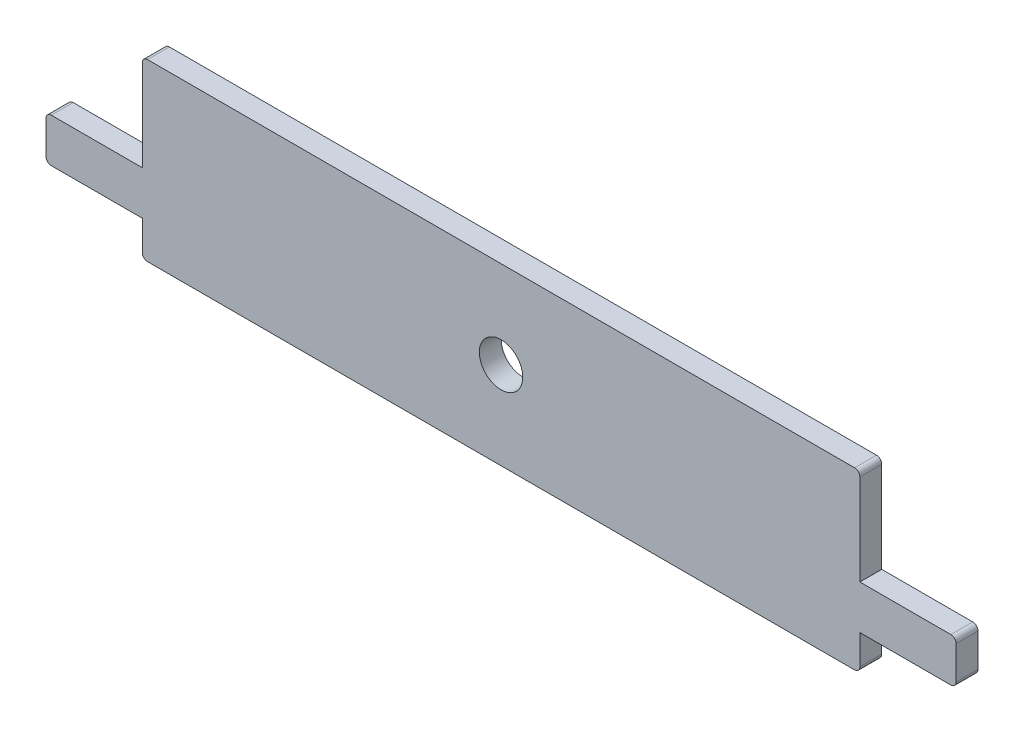
ISO-10303-21;
HEADER;
FILE_DESCRIPTION(('STEP AP214'),'2;1');
FILE_NAME('part.step','',(''),(''),'','','');
FILE_SCHEMA(('AUTOMOTIVE_DESIGN { 1 0 10303 214 1 1 1 1 }'));
ENDSEC;
DATA;
#1=APPLICATION_CONTEXT('core data for automotive mechanical design processes');
#2=APPLICATION_PROTOCOL_DEFINITION('international standard','automotive_design',2000,#1);
#3=PRODUCT_CONTEXT('',#1,'mechanical');
#4=PRODUCT('Part','Part','',(#3));
#5=PRODUCT_RELATED_PRODUCT_CATEGORY('part','',(#4));
#6=PRODUCT_DEFINITION_FORMATION('','',#4);
#7=PRODUCT_DEFINITION_CONTEXT('part definition',#1,'design');
#8=PRODUCT_DEFINITION('design','',#6,#7);
#9=PRODUCT_DEFINITION_SHAPE('','',#8);
#10=(LENGTH_UNIT() NAMED_UNIT(*) SI_UNIT(.MILLI.,.METRE.));
#11=(NAMED_UNIT(*) PLANE_ANGLE_UNIT() SI_UNIT($,.RADIAN.));
#12=(NAMED_UNIT(*) SI_UNIT($,.STERADIAN.) SOLID_ANGLE_UNIT());
#13=UNCERTAINTY_MEASURE_WITH_UNIT(LENGTH_MEASURE(1.E-05),#10,'distance_accuracy_value','');
#14=(GEOMETRIC_REPRESENTATION_CONTEXT(3) GLOBAL_UNCERTAINTY_ASSIGNED_CONTEXT((#13)) GLOBAL_UNIT_ASSIGNED_CONTEXT((#10,
#11,#12)) REPRESENTATION_CONTEXT('',''));
#15=CARTESIAN_POINT('',(0.,0.,0.));
#16=DIRECTION('',(0.,0.,1.));
#17=DIRECTION('',(1.,0.,0.));
#18=AXIS2_PLACEMENT_3D('',#15,#16,#17);
#19=CARTESIAN_POINT('',(103.378,0.762,3.175));
#20=DIRECTION('',(0.,0.,1.));
#21=DIRECTION('',(1.,0.,0.));
#22=AXIS2_PLACEMENT_3D('',#19,#20,#21);
#23=PLANE('',#22);
#24=CARTESIAN_POINT('',(103.378,0.762,3.175));
#25=DIRECTION('',(0.,0.,1.));
#26=DIRECTION('',(1.,0.,0.));
#27=AXIS2_PLACEMENT_3D('',#24,#25,#26);
#28=CIRCLE('',#27,0.761999999999999);
#29=CARTESIAN_POINT('',(103.378,0.,3.175));
#30=VERTEX_POINT('',#29);
#31=CARTESIAN_POINT('',(104.14,0.762000000000005,3.175));
#32=VERTEX_POINT('',#31);
#33=EDGE_CURVE('E240',#30,#32,#28,.T.);
#34=ORIENTED_EDGE('',*,*,#33,.T.);
#35=DIRECTION('',(0.,1.,0.));
#36=VECTOR('',#35,1.);
#37=CARTESIAN_POINT('',(104.14,0.762000000000005,3.175));
#38=LINE('',#37,#36);
#39=CARTESIAN_POINT('',(104.14,5.08000000000001,3.175));
#40=VERTEX_POINT('',#39);
#41=EDGE_CURVE('E128',#32,#40,#38,.T.);
#42=ORIENTED_EDGE('',*,*,#41,.T.);
#43=DIRECTION('',(1.,0.,0.));
#44=VECTOR('',#43,1.);
#45=CARTESIAN_POINT('',(104.14,5.08000000000001,3.175));
#46=LINE('',#45,#44);
#47=CARTESIAN_POINT('',(117.348,5.08000000000001,3.175));
#48=VERTEX_POINT('',#47);
#49=EDGE_CURVE('E291',#40,#48,#46,.T.);
#50=ORIENTED_EDGE('',*,*,#49,.T.);
#51=CARTESIAN_POINT('',(117.348,5.84200000000001,3.175));
#52=DIRECTION('',(0.,0.,1.));
#53=DIRECTION('',(1.,0.,0.));
#54=AXIS2_PLACEMENT_3D('',#51,#52,#53);
#55=CIRCLE('',#54,0.761999999999999);
#56=CARTESIAN_POINT('',(118.11,5.84200000000002,3.175));
#57=VERTEX_POINT('',#56);
#58=EDGE_CURVE('E310',#48,#57,#55,.T.);
#59=ORIENTED_EDGE('',*,*,#58,.T.);
#60=DIRECTION('',(0.,1.,0.));
#61=VECTOR('',#60,1.);
#62=CARTESIAN_POINT('',(118.11,5.84200000000002,3.175));
#63=LINE('',#62,#61);
#64=CARTESIAN_POINT('',(118.11,10.668,3.175));
#65=VERTEX_POINT('',#64);
#66=EDGE_CURVE('E307',#57,#65,#63,.T.);
#67=ORIENTED_EDGE('',*,*,#66,.T.);
#68=CARTESIAN_POINT('',(117.348,10.668,3.175));
#69=DIRECTION('',(0.,0.,1.));
#70=DIRECTION('',(-1.,0.,0.));
#71=AXIS2_PLACEMENT_3D('',#68,#69,#70);
#72=CIRCLE('',#71,0.762);
#73=CARTESIAN_POINT('',(117.348,11.43,3.175));
#74=VERTEX_POINT('',#73);
#75=EDGE_CURVE('E309',#65,#74,#72,.T.);
#76=ORIENTED_EDGE('',*,*,#75,.T.);
#77=DIRECTION('',(-1.,0.,0.));
#78=VECTOR('',#77,1.);
#79=CARTESIAN_POINT('',(104.14,11.43,3.175));
#80=LINE('',#79,#78);
#81=CARTESIAN_POINT('',(104.14,11.43,3.175));
#82=VERTEX_POINT('',#81);
#83=EDGE_CURVE('E312',#74,#82,#80,.T.);
#84=ORIENTED_EDGE('',*,*,#83,.T.);
#85=DIRECTION('',(0.,1.,0.));
#86=VECTOR('',#85,1.);
#87=CARTESIAN_POINT('',(104.14,11.43,3.175));
#88=LINE('',#87,#86);
#89=CARTESIAN_POINT('',(104.14,24.638,3.175));
#90=VERTEX_POINT('',#89);
#91=EDGE_CURVE('E318',#82,#90,#88,.T.);
#92=ORIENTED_EDGE('',*,*,#91,.T.);
#93=CARTESIAN_POINT('',(103.378,24.638,3.175));
#94=DIRECTION('',(0.,0.,1.));
#95=DIRECTION('',(-1.,0.,0.));
#96=AXIS2_PLACEMENT_3D('',#93,#94,#95);
#97=CIRCLE('',#96,0.761999999999999);
#98=CARTESIAN_POINT('',(103.378,25.4,3.175));
#99=VERTEX_POINT('',#98);
#100=EDGE_CURVE('E320',#90,#99,#97,.T.);
#101=ORIENTED_EDGE('',*,*,#100,.T.);
#102=DIRECTION('',(-1.,0.,0.));
#103=VECTOR('',#102,1.);
#104=CARTESIAN_POINT('',(0.762000000000005,25.4,3.175));
#105=LINE('',#104,#103);
#106=CARTESIAN_POINT('',(0.762000000000005,25.4,3.175));
#107=VERTEX_POINT('',#106);
#108=EDGE_CURVE('E322',#99,#107,#105,.T.);
#109=ORIENTED_EDGE('',*,*,#108,.T.);
#110=CARTESIAN_POINT('',(0.762,24.638,3.175));
#111=DIRECTION('',(0.,0.,1.));
#112=DIRECTION('',(-1.,0.,0.));
#113=AXIS2_PLACEMENT_3D('',#110,#111,#112);
#114=CIRCLE('',#113,0.761999999999999);
#115=CARTESIAN_POINT('',(0.,24.638,3.175));
#116=VERTEX_POINT('',#115);
#117=EDGE_CURVE('E324',#107,#116,#114,.T.);
#118=ORIENTED_EDGE('',*,*,#117,.T.);
#119=DIRECTION('',(0.,-1.,0.));
#120=VECTOR('',#119,1.);
#121=CARTESIAN_POINT('',(0.,11.43,3.175));
#122=LINE('',#121,#120);
#123=CARTESIAN_POINT('',(0.,11.43,3.175));
#124=VERTEX_POINT('',#123);
#125=EDGE_CURVE('E326',#116,#124,#122,.T.);
#126=ORIENTED_EDGE('',*,*,#125,.T.);
#127=DIRECTION('',(-1.,0.,0.));
#128=VECTOR('',#127,1.);
#129=CARTESIAN_POINT('',(-13.208,11.43,3.175));
#130=LINE('',#129,#128);
#131=CARTESIAN_POINT('',(-13.208,11.43,3.175));
#132=VERTEX_POINT('',#131);
#133=EDGE_CURVE('E328',#124,#132,#130,.T.);
#134=ORIENTED_EDGE('',*,*,#133,.T.);
#135=CARTESIAN_POINT('',(-13.208,10.668,3.175));
#136=DIRECTION('',(0.,0.,1.));
#137=DIRECTION('',(-1.,0.,0.));
#138=AXIS2_PLACEMENT_3D('',#135,#136,#137);
#139=CIRCLE('',#138,0.762000000000001);
#140=CARTESIAN_POINT('',(-13.97,10.668,3.175));
#141=VERTEX_POINT('',#140);
#142=EDGE_CURVE('E330',#132,#141,#139,.T.);
#143=ORIENTED_EDGE('',*,*,#142,.T.);
#144=DIRECTION('',(0.,-1.,0.));
#145=VECTOR('',#144,1.);
#146=CARTESIAN_POINT('',(-13.97,5.842,3.175));
#147=LINE('',#146,#145);
#148=CARTESIAN_POINT('',(-13.97,5.842,3.175));
#149=VERTEX_POINT('',#148);
#150=EDGE_CURVE('E332',#141,#149,#147,.T.);
#151=ORIENTED_EDGE('',*,*,#150,.T.);
#152=CARTESIAN_POINT('',(-13.208,5.842,3.175));
#153=DIRECTION('',(0.,0.,1.));
#154=DIRECTION('',(-1.,0.,0.));
#155=AXIS2_PLACEMENT_3D('',#152,#153,#154);
#156=CIRCLE('',#155,0.762000000000001);
#157=CARTESIAN_POINT('',(-13.208,5.07999999999999,3.175));
#158=VERTEX_POINT('',#157);
#159=EDGE_CURVE('E334',#149,#158,#156,.T.);
#160=ORIENTED_EDGE('',*,*,#159,.T.);
#161=DIRECTION('',(1.,0.,0.));
#162=VECTOR('',#161,1.);
#163=CARTESIAN_POINT('',(-13.208,5.07999999999999,3.175));
#164=LINE('',#163,#162);
#165=CARTESIAN_POINT('',(0.,5.08,3.175));
#166=VERTEX_POINT('',#165);
#167=EDGE_CURVE('E183',#158,#166,#164,.T.);
#168=ORIENTED_EDGE('',*,*,#167,.T.);
#169=DIRECTION('',(0.,-1.,0.));
#170=VECTOR('',#169,1.);
#171=CARTESIAN_POINT('',(0.,0.762000000000005,3.175));
#172=LINE('',#171,#170);
#173=CARTESIAN_POINT('',(0.,0.762,3.175));
#174=VERTEX_POINT('',#173);
#175=EDGE_CURVE('E177',#166,#174,#172,.T.);
#176=ORIENTED_EDGE('',*,*,#175,.T.);
#177=CARTESIAN_POINT('',(0.762,0.762,3.175));
#178=DIRECTION('',(0.,0.,1.));
#179=DIRECTION('',(-1.,0.,0.));
#180=AXIS2_PLACEMENT_3D('',#177,#178,#179);
#181=CIRCLE('',#180,0.762);
#182=CARTESIAN_POINT('',(0.762000000000005,0.,3.175));
#183=VERTEX_POINT('',#182);
#184=EDGE_CURVE('E181',#174,#183,#181,.T.);
#185=ORIENTED_EDGE('',*,*,#184,.T.);
#186=DIRECTION('',(1.,0.,0.));
#187=VECTOR('',#186,1.);
#188=CARTESIAN_POINT('',(0.762000000000005,0.,3.175));
#189=LINE('',#188,#187);
#190=EDGE_CURVE('E49',#183,#30,#189,.T.);
#191=ORIENTED_EDGE('',*,*,#190,.T.);
#192=EDGE_LOOP('',(#34,#42,#50,#59,#67,#76,#84,#92,#101,#109,#118,#126,#134,#143,#151,#160,#168,
#176,#185,#191));
#193=FACE_BOUND('',#192,.T.);
#194=CARTESIAN_POINT('',(52.07,12.7,3.175));
#195=DIRECTION('',(0.,0.,1.));
#196=DIRECTION('',(1.,0.,0.));
#197=AXIS2_PLACEMENT_3D('',#194,#195,#196);
#198=CIRCLE('',#197,3.1496);
#199=CARTESIAN_POINT('',(55.2196,12.7,3.175));
#200=VERTEX_POINT('',#199);
#201=EDGE_CURVE('E205',#200,#200,#198,.T.);
#202=ORIENTED_EDGE('',*,*,#201,.F.);
#203=EDGE_LOOP('',(#202));
#204=FACE_BOUND('',#203,.T.);
#205=ADVANCED_FACE('F32',(#193,#204),#23,.T.);
#206=CARTESIAN_POINT('',(103.378,0.762,0.));
#207=DIRECTION('',(0.,0.,1.));
#208=DIRECTION('',(1.,0.,0.));
#209=AXIS2_PLACEMENT_3D('',#206,#207,#208);
#210=PLANE('',#209);
#211=CARTESIAN_POINT('',(103.378,0.762,0.));
#212=DIRECTION('',(0.,0.,1.));
#213=DIRECTION('',(1.,0.,0.));
#214=AXIS2_PLACEMENT_3D('',#211,#212,#213);
#215=CIRCLE('',#214,0.761999999999999);
#216=CARTESIAN_POINT('',(103.378,0.,0.));
#217=VERTEX_POINT('',#216);
#218=CARTESIAN_POINT('',(104.14,0.762000000000005,0.));
#219=VERTEX_POINT('',#218);
#220=EDGE_CURVE('E201',#217,#219,#215,.T.);
#221=ORIENTED_EDGE('',*,*,#220,.F.);
#222=DIRECTION('',(1.,0.,0.));
#223=VECTOR('',#222,1.);
#224=CARTESIAN_POINT('',(0.762000000000005,0.,0.));
#225=LINE('',#224,#223);
#226=CARTESIAN_POINT('',(0.762000000000005,0.,0.));
#227=VERTEX_POINT('',#226);
#228=EDGE_CURVE('E120',#227,#217,#225,.T.);
#229=ORIENTED_EDGE('',*,*,#228,.F.);
#230=CARTESIAN_POINT('',(0.762,0.762,0.));
#231=DIRECTION('',(0.,0.,1.));
#232=DIRECTION('',(-1.,0.,0.));
#233=AXIS2_PLACEMENT_3D('',#230,#231,#232);
#234=CIRCLE('',#233,0.762);
#235=CARTESIAN_POINT('',(0.,0.762,0.));
#236=VERTEX_POINT('',#235);
#237=EDGE_CURVE('E114',#236,#227,#234,.T.);
#238=ORIENTED_EDGE('',*,*,#237,.F.);
#239=DIRECTION('',(0.,-1.,0.));
#240=VECTOR('',#239,1.);
#241=CARTESIAN_POINT('',(0.,0.762000000000005,0.));
#242=LINE('',#241,#240);
#243=CARTESIAN_POINT('',(0.,5.08,0.));
#244=VERTEX_POINT('',#243);
#245=EDGE_CURVE('E191',#244,#236,#242,.T.);
#246=ORIENTED_EDGE('',*,*,#245,.F.);
#247=DIRECTION('',(1.,0.,0.));
#248=VECTOR('',#247,1.);
#249=CARTESIAN_POINT('',(-13.208,5.07999999999999,0.));
#250=LINE('',#249,#248);
#251=CARTESIAN_POINT('',(-13.208,5.07999999999999,0.));
#252=VERTEX_POINT('',#251);
#253=EDGE_CURVE('E235',#252,#244,#250,.T.);
#254=ORIENTED_EDGE('',*,*,#253,.F.);
#255=CARTESIAN_POINT('',(-13.208,5.842,0.));
#256=DIRECTION('',(0.,0.,1.));
#257=DIRECTION('',(-1.,0.,0.));
#258=AXIS2_PLACEMENT_3D('',#255,#256,#257);
#259=CIRCLE('',#258,0.762000000000001);
#260=CARTESIAN_POINT('',(-13.97,5.842,0.));
#261=VERTEX_POINT('',#260);
#262=EDGE_CURVE('E233',#261,#252,#259,.T.);
#263=ORIENTED_EDGE('',*,*,#262,.F.);
#264=DIRECTION('',(0.,-1.,0.));
#265=VECTOR('',#264,1.);
#266=CARTESIAN_POINT('',(-13.97,5.842,0.));
#267=LINE('',#266,#265);
#268=CARTESIAN_POINT('',(-13.97,10.668,0.));
#269=VERTEX_POINT('',#268);
#270=EDGE_CURVE('E231',#269,#261,#267,.T.);
#271=ORIENTED_EDGE('',*,*,#270,.F.);
#272=CARTESIAN_POINT('',(-13.208,10.668,0.));
#273=DIRECTION('',(0.,0.,1.));
#274=DIRECTION('',(-1.,0.,0.));
#275=AXIS2_PLACEMENT_3D('',#272,#273,#274);
#276=CIRCLE('',#275,0.762000000000001);
#277=CARTESIAN_POINT('',(-13.208,11.43,0.));
#278=VERTEX_POINT('',#277);
#279=EDGE_CURVE('E229',#278,#269,#276,.T.);
#280=ORIENTED_EDGE('',*,*,#279,.F.);
#281=DIRECTION('',(-1.,0.,0.));
#282=VECTOR('',#281,1.);
#283=CARTESIAN_POINT('',(-13.208,11.43,0.));
#284=LINE('',#283,#282);
#285=CARTESIAN_POINT('',(0.,11.43,0.));
#286=VERTEX_POINT('',#285);
#287=EDGE_CURVE('E227',#286,#278,#284,.T.);
#288=ORIENTED_EDGE('',*,*,#287,.F.);
#289=DIRECTION('',(0.,-1.,0.));
#290=VECTOR('',#289,1.);
#291=CARTESIAN_POINT('',(0.,11.43,0.));
#292=LINE('',#291,#290);
#293=CARTESIAN_POINT('',(0.,24.638,0.));
#294=VERTEX_POINT('',#293);
#295=EDGE_CURVE('E225',#294,#286,#292,.T.);
#296=ORIENTED_EDGE('',*,*,#295,.F.);
#297=CARTESIAN_POINT('',(0.762,24.638,0.));
#298=DIRECTION('',(0.,0.,1.));
#299=DIRECTION('',(-1.,0.,0.));
#300=AXIS2_PLACEMENT_3D('',#297,#298,#299);
#301=CIRCLE('',#300,0.761999999999999);
#302=CARTESIAN_POINT('',(0.762000000000005,25.4,0.));
#303=VERTEX_POINT('',#302);
#304=EDGE_CURVE('E223',#303,#294,#301,.T.);
#305=ORIENTED_EDGE('',*,*,#304,.F.);
#306=DIRECTION('',(-1.,0.,0.));
#307=VECTOR('',#306,1.);
#308=CARTESIAN_POINT('',(0.762000000000005,25.4,0.));
#309=LINE('',#308,#307);
#310=CARTESIAN_POINT('',(103.378,25.4,0.));
#311=VERTEX_POINT('',#310);
#312=EDGE_CURVE('E221',#311,#303,#309,.T.);
#313=ORIENTED_EDGE('',*,*,#312,.F.);
#314=CARTESIAN_POINT('',(103.378,24.638,0.));
#315=DIRECTION('',(0.,0.,1.));
#316=DIRECTION('',(-1.,0.,0.));
#317=AXIS2_PLACEMENT_3D('',#314,#315,#316);
#318=CIRCLE('',#317,0.761999999999999);
#319=CARTESIAN_POINT('',(104.14,24.638,0.));
#320=VERTEX_POINT('',#319);
#321=EDGE_CURVE('E219',#320,#311,#318,.T.);
#322=ORIENTED_EDGE('',*,*,#321,.F.);
#323=DIRECTION('',(0.,1.,0.));
#324=VECTOR('',#323,1.);
#325=CARTESIAN_POINT('',(104.14,11.43,0.));
#326=LINE('',#325,#324);
#327=CARTESIAN_POINT('',(104.14,11.43,0.));
#328=VERTEX_POINT('',#327);
#329=EDGE_CURVE('E217',#328,#320,#326,.T.);
#330=ORIENTED_EDGE('',*,*,#329,.F.);
#331=DIRECTION('',(-1.,0.,0.));
#332=VECTOR('',#331,1.);
#333=CARTESIAN_POINT('',(104.14,11.43,0.));
#334=LINE('',#333,#332);
#335=CARTESIAN_POINT('',(117.348,11.43,0.));
#336=VERTEX_POINT('',#335);
#337=EDGE_CURVE('E215',#336,#328,#334,.T.);
#338=ORIENTED_EDGE('',*,*,#337,.F.);
#339=CARTESIAN_POINT('',(117.348,10.668,0.));
#340=DIRECTION('',(0.,0.,1.));
#341=DIRECTION('',(-1.,0.,0.));
#342=AXIS2_PLACEMENT_3D('',#339,#340,#341);
#343=CIRCLE('',#342,0.762);
#344=CARTESIAN_POINT('',(118.11,10.668,0.));
#345=VERTEX_POINT('',#344);
#346=EDGE_CURVE('E213',#345,#336,#343,.T.);
#347=ORIENTED_EDGE('',*,*,#346,.F.);
#348=DIRECTION('',(0.,1.,0.));
#349=VECTOR('',#348,1.);
#350=CARTESIAN_POINT('',(118.11,5.84200000000002,0.));
#351=LINE('',#350,#349);
#352=CARTESIAN_POINT('',(118.11,5.84200000000002,0.));
#353=VERTEX_POINT('',#352);
#354=EDGE_CURVE('E211',#353,#345,#351,.T.);
#355=ORIENTED_EDGE('',*,*,#354,.F.);
#356=CARTESIAN_POINT('',(117.348,5.84200000000001,0.));
#357=DIRECTION('',(0.,0.,1.));
#358=DIRECTION('',(1.,0.,0.));
#359=AXIS2_PLACEMENT_3D('',#356,#357,#358);
#360=CIRCLE('',#359,0.761999999999999);
#361=CARTESIAN_POINT('',(117.348,5.08000000000001,0.));
#362=VERTEX_POINT('',#361);
#363=EDGE_CURVE('E209',#362,#353,#360,.T.);
#364=ORIENTED_EDGE('',*,*,#363,.F.);
#365=DIRECTION('',(1.,0.,0.));
#366=VECTOR('',#365,1.);
#367=CARTESIAN_POINT('',(104.14,5.08000000000001,0.));
#368=LINE('',#367,#366);
#369=CARTESIAN_POINT('',(104.14,5.08000000000001,0.));
#370=VERTEX_POINT('',#369);
#371=EDGE_CURVE('E207',#370,#362,#368,.T.);
#372=ORIENTED_EDGE('',*,*,#371,.F.);
#373=DIRECTION('',(0.,1.,0.));
#374=VECTOR('',#373,1.);
#375=CARTESIAN_POINT('',(104.14,0.762000000000005,0.));
#376=LINE('',#375,#374);
#377=EDGE_CURVE('E204',#219,#370,#376,.T.);
#378=ORIENTED_EDGE('',*,*,#377,.F.);
#379=EDGE_LOOP('',(#221,#229,#238,#246,#254,#263,#271,#280,#288,#296,#305,#313,#322,#330,#338,
#347,#355,#364,#372,#378));
#380=FACE_BOUND('',#379,.T.);
#381=CARTESIAN_POINT('',(52.07,12.7,0.));
#382=DIRECTION('',(0.,0.,1.));
#383=DIRECTION('',(1.,0.,0.));
#384=AXIS2_PLACEMENT_3D('',#381,#382,#383);
#385=CIRCLE('',#384,3.1496);
#386=CARTESIAN_POINT('',(55.2196,12.7,0.));
#387=VERTEX_POINT('',#386);
#388=EDGE_CURVE('E585',#387,#387,#385,.T.);
#389=ORIENTED_EDGE('',*,*,#388,.T.);
#390=EDGE_LOOP('',(#389));
#391=FACE_BOUND('',#390,.T.);
#392=ADVANCED_FACE('F295',(#380,#391),#210,.F.);
#393=CARTESIAN_POINT('',(103.378,0.762,3.175));
#394=DIRECTION('',(0.,0.,-1.));
#395=DIRECTION('',(-1.,0.,0.));
#396=AXIS2_PLACEMENT_3D('',#393,#394,#395);
#397=CYLINDRICAL_SURFACE('',#396,0.761999999999999);
#398=ORIENTED_EDGE('',*,*,#220,.T.);
#399=DIRECTION('',(0.,0.,-1.));
#400=VECTOR('',#399,1.);
#401=CARTESIAN_POINT('',(104.14,0.762000000000005,3.175));
#402=LINE('',#401,#400);
#403=EDGE_CURVE('E11',#32,#219,#402,.T.);
#404=ORIENTED_EDGE('',*,*,#403,.F.);
#405=ORIENTED_EDGE('',*,*,#33,.F.);
#406=DIRECTION('',(0.,0.,-1.));
#407=VECTOR('',#406,1.);
#408=CARTESIAN_POINT('',(103.378,0.,3.175));
#409=LINE('',#408,#407);
#410=EDGE_CURVE('E197',#30,#217,#409,.T.);
#411=ORIENTED_EDGE('',*,*,#410,.T.);
#412=EDGE_LOOP('',(#398,#404,#405,#411));
#413=FACE_BOUND('',#412,.T.);
#414=ADVANCED_FACE('F34',(#413),#397,.T.);
#415=CARTESIAN_POINT('',(104.14,0.762000000000005,3.175));
#416=DIRECTION('',(-1.,0.,0.));
#417=DIRECTION('',(0.,0.,1.));
#418=AXIS2_PLACEMENT_3D('',#415,#416,#417);
#419=PLANE('',#418);
#420=ORIENTED_EDGE('',*,*,#377,.T.);
#421=DIRECTION('',(0.,0.,-1.));
#422=VECTOR('',#421,1.);
#423=CARTESIAN_POINT('',(104.14,5.08000000000001,3.175));
#424=LINE('',#423,#422);
#425=EDGE_CURVE('E41',#40,#370,#424,.T.);
#426=ORIENTED_EDGE('',*,*,#425,.F.);
#427=ORIENTED_EDGE('',*,*,#41,.F.);
#428=ORIENTED_EDGE('',*,*,#403,.T.);
#429=EDGE_LOOP('',(#420,#426,#427,#428));
#430=FACE_BOUND('',#429,.T.);
#431=ADVANCED_FACE('F368',(#430),#419,.F.);
#432=CARTESIAN_POINT('',(104.14,5.08000000000001,3.175));
#433=DIRECTION('',(0.,1.,0.));
#434=DIRECTION('',(-1.,0.,0.));
#435=AXIS2_PLACEMENT_3D('',#432,#433,#434);
#436=PLANE('',#435);
#437=ORIENTED_EDGE('',*,*,#371,.T.);
#438=DIRECTION('',(0.,0.,-1.));
#439=VECTOR('',#438,1.);
#440=CARTESIAN_POINT('',(117.348,5.08000000000001,3.175));
#441=LINE('',#440,#439);
#442=EDGE_CURVE('E283',#48,#362,#441,.T.);
#443=ORIENTED_EDGE('',*,*,#442,.F.);
#444=ORIENTED_EDGE('',*,*,#49,.F.);
#445=ORIENTED_EDGE('',*,*,#425,.T.);
#446=EDGE_LOOP('',(#437,#443,#444,#445));
#447=FACE_BOUND('',#446,.T.);
#448=ADVANCED_FACE('F289',(#447),#436,.F.);
#449=CARTESIAN_POINT('',(117.348,5.84200000000001,3.175));
#450=DIRECTION('',(0.,0.,-1.));
#451=DIRECTION('',(-1.,0.,0.));
#452=AXIS2_PLACEMENT_3D('',#449,#450,#451);
#453=CYLINDRICAL_SURFACE('',#452,0.761999999999999);
#454=ORIENTED_EDGE('',*,*,#363,.T.);
#455=DIRECTION('',(0.,0.,-1.));
#456=VECTOR('',#455,1.);
#457=CARTESIAN_POINT('',(118.11,5.84200000000002,3.175));
#458=LINE('',#457,#456);
#459=EDGE_CURVE('E280',#57,#353,#458,.T.);
#460=ORIENTED_EDGE('',*,*,#459,.F.);
#461=ORIENTED_EDGE('',*,*,#58,.F.);
#462=ORIENTED_EDGE('',*,*,#442,.T.);
#463=EDGE_LOOP('',(#454,#460,#461,#462));
#464=FACE_BOUND('',#463,.T.);
#465=ADVANCED_FACE('F301',(#464),#453,.T.);
#466=CARTESIAN_POINT('',(118.11,5.84200000000002,3.175));
#467=DIRECTION('',(-1.,0.,0.));
#468=DIRECTION('',(0.,0.,1.));
#469=AXIS2_PLACEMENT_3D('',#466,#467,#468);
#470=PLANE('',#469);
#471=ORIENTED_EDGE('',*,*,#354,.T.);
#472=DIRECTION('',(0.,0.,-1.));
#473=VECTOR('',#472,1.);
#474=CARTESIAN_POINT('',(118.11,10.668,3.175));
#475=LINE('',#474,#473);
#476=EDGE_CURVE('E277',#65,#345,#475,.T.);
#477=ORIENTED_EDGE('',*,*,#476,.F.);
#478=ORIENTED_EDGE('',*,*,#66,.F.);
#479=ORIENTED_EDGE('',*,*,#459,.T.);
#480=EDGE_LOOP('',(#471,#477,#478,#479));
#481=FACE_BOUND('',#480,.T.);
#482=ADVANCED_FACE('F305',(#481),#470,.F.);
#483=CARTESIAN_POINT('',(117.348,10.668,3.175));
#484=DIRECTION('',(0.,0.,-1.));
#485=DIRECTION('',(-1.,0.,0.));
#486=AXIS2_PLACEMENT_3D('',#483,#484,#485);
#487=CYLINDRICAL_SURFACE('',#486,0.762);
#488=ORIENTED_EDGE('',*,*,#346,.T.);
#489=DIRECTION('',(0.,0.,-1.));
#490=VECTOR('',#489,1.);
#491=CARTESIAN_POINT('',(117.348,11.43,3.175));
#492=LINE('',#491,#490);
#493=EDGE_CURVE('E274',#74,#336,#492,.T.);
#494=ORIENTED_EDGE('',*,*,#493,.F.);
#495=ORIENTED_EDGE('',*,*,#75,.F.);
#496=ORIENTED_EDGE('',*,*,#476,.T.);
#497=EDGE_LOOP('',(#488,#494,#495,#496));
#498=FACE_BOUND('',#497,.T.);
#499=ADVANCED_FACE('F381',(#498),#487,.T.);
#500=CARTESIAN_POINT('',(104.14,11.43,3.175));
#501=DIRECTION('',(0.,-1.,0.));
#502=DIRECTION('',(1.,0.,0.));
#503=AXIS2_PLACEMENT_3D('',#500,#501,#502);
#504=PLANE('',#503);
#505=ORIENTED_EDGE('',*,*,#337,.T.);
#506=DIRECTION('',(0.,0.,-1.));
#507=VECTOR('',#506,1.);
#508=CARTESIAN_POINT('',(104.14,11.43,3.175));
#509=LINE('',#508,#507);
#510=EDGE_CURVE('E271',#82,#328,#509,.T.);
#511=ORIENTED_EDGE('',*,*,#510,.F.);
#512=ORIENTED_EDGE('',*,*,#83,.F.);
#513=ORIENTED_EDGE('',*,*,#493,.T.);
#514=EDGE_LOOP('',(#505,#511,#512,#513));
#515=FACE_BOUND('',#514,.T.);
#516=ADVANCED_FACE('F384',(#515),#504,.F.);
#517=CARTESIAN_POINT('',(104.14,11.43,3.175));
#518=DIRECTION('',(-1.,0.,0.));
#519=DIRECTION('',(0.,0.,1.));
#520=AXIS2_PLACEMENT_3D('',#517,#518,#519);
#521=PLANE('',#520);
#522=ORIENTED_EDGE('',*,*,#329,.T.);
#523=DIRECTION('',(0.,0.,-1.));
#524=VECTOR('',#523,1.);
#525=CARTESIAN_POINT('',(104.14,24.638,3.175));
#526=LINE('',#525,#524);
#527=EDGE_CURVE('E268',#90,#320,#526,.T.);
#528=ORIENTED_EDGE('',*,*,#527,.F.);
#529=ORIENTED_EDGE('',*,*,#91,.F.);
#530=ORIENTED_EDGE('',*,*,#510,.T.);
#531=EDGE_LOOP('',(#522,#528,#529,#530));
#532=FACE_BOUND('',#531,.T.);
#533=ADVANCED_FACE('F388',(#532),#521,.F.);
#534=CARTESIAN_POINT('',(103.378,24.638,3.175));
#535=DIRECTION('',(0.,0.,-1.));
#536=DIRECTION('',(-1.,0.,0.));
#537=AXIS2_PLACEMENT_3D('',#534,#535,#536);
#538=CYLINDRICAL_SURFACE('',#537,0.761999999999999);
#539=ORIENTED_EDGE('',*,*,#321,.T.);
#540=DIRECTION('',(0.,0.,-1.));
#541=VECTOR('',#540,1.);
#542=CARTESIAN_POINT('',(103.378,25.4,3.175));
#543=LINE('',#542,#541);
#544=EDGE_CURVE('E265',#99,#311,#543,.T.);
#545=ORIENTED_EDGE('',*,*,#544,.F.);
#546=ORIENTED_EDGE('',*,*,#100,.F.);
#547=ORIENTED_EDGE('',*,*,#527,.T.);
#548=EDGE_LOOP('',(#539,#545,#546,#547));
#549=FACE_BOUND('',#548,.T.);
#550=ADVANCED_FACE('F392',(#549),#538,.T.);
#551=CARTESIAN_POINT('',(0.762000000000005,25.4,3.175));
#552=DIRECTION('',(0.,-1.,0.));
#553=DIRECTION('',(0.,0.,-1.));
#554=AXIS2_PLACEMENT_3D('',#551,#552,#553);
#555=PLANE('',#554);
#556=ORIENTED_EDGE('',*,*,#312,.T.);
#557=DIRECTION('',(0.,0.,-1.));
#558=VECTOR('',#557,1.);
#559=CARTESIAN_POINT('',(0.762000000000005,25.4,3.175));
#560=LINE('',#559,#558);
#561=EDGE_CURVE('E262',#107,#303,#560,.T.);
#562=ORIENTED_EDGE('',*,*,#561,.F.);
#563=ORIENTED_EDGE('',*,*,#108,.F.);
#564=ORIENTED_EDGE('',*,*,#544,.T.);
#565=EDGE_LOOP('',(#556,#562,#563,#564));
#566=FACE_BOUND('',#565,.T.);
#567=ADVANCED_FACE('F396',(#566),#555,.F.);
#568=CARTESIAN_POINT('',(0.762,24.638,3.175));
#569=DIRECTION('',(0.,0.,-1.));
#570=DIRECTION('',(-1.,0.,0.));
#571=AXIS2_PLACEMENT_3D('',#568,#569,#570);
#572=CYLINDRICAL_SURFACE('',#571,0.761999999999999);
#573=ORIENTED_EDGE('',*,*,#304,.T.);
#574=DIRECTION('',(0.,0.,-1.));
#575=VECTOR('',#574,1.);
#576=CARTESIAN_POINT('',(0.,24.638,3.175));
#577=LINE('',#576,#575);
#578=EDGE_CURVE('E259',#116,#294,#577,.T.);
#579=ORIENTED_EDGE('',*,*,#578,.F.);
#580=ORIENTED_EDGE('',*,*,#117,.F.);
#581=ORIENTED_EDGE('',*,*,#561,.T.);
#582=EDGE_LOOP('',(#573,#579,#580,#581));
#583=FACE_BOUND('',#582,.T.);
#584=ADVANCED_FACE('F400',(#583),#572,.T.);
#585=CARTESIAN_POINT('',(0.,11.43,3.175));
#586=DIRECTION('',(1.,0.,0.));
#587=DIRECTION('',(0.,0.,-1.));
#588=AXIS2_PLACEMENT_3D('',#585,#586,#587);
#589=PLANE('',#588);
#590=ORIENTED_EDGE('',*,*,#295,.T.);
#591=DIRECTION('',(0.,0.,-1.));
#592=VECTOR('',#591,1.);
#593=CARTESIAN_POINT('',(0.,11.43,3.175));
#594=LINE('',#593,#592);
#595=EDGE_CURVE('E256',#124,#286,#594,.T.);
#596=ORIENTED_EDGE('',*,*,#595,.F.);
#597=ORIENTED_EDGE('',*,*,#125,.F.);
#598=ORIENTED_EDGE('',*,*,#578,.T.);
#599=EDGE_LOOP('',(#590,#596,#597,#598));
#600=FACE_BOUND('',#599,.T.);
#601=ADVANCED_FACE('F404',(#600),#589,.F.);
#602=CARTESIAN_POINT('',(-13.208,11.43,3.175));
#603=DIRECTION('',(0.,-1.,0.));
#604=DIRECTION('',(1.,0.,0.));
#605=AXIS2_PLACEMENT_3D('',#602,#603,#604);
#606=PLANE('',#605);
#607=ORIENTED_EDGE('',*,*,#287,.T.);
#608=DIRECTION('',(0.,0.,-1.));
#609=VECTOR('',#608,1.);
#610=CARTESIAN_POINT('',(-13.208,11.43,3.175));
#611=LINE('',#610,#609);
#612=EDGE_CURVE('E253',#132,#278,#611,.T.);
#613=ORIENTED_EDGE('',*,*,#612,.F.);
#614=ORIENTED_EDGE('',*,*,#133,.F.);
#615=ORIENTED_EDGE('',*,*,#595,.T.);
#616=EDGE_LOOP('',(#607,#613,#614,#615));
#617=FACE_BOUND('',#616,.T.);
#618=ADVANCED_FACE('F408',(#617),#606,.F.);
#619=CARTESIAN_POINT('',(-13.208,10.668,3.175));
#620=DIRECTION('',(0.,0.,-1.));
#621=DIRECTION('',(-1.,0.,0.));
#622=AXIS2_PLACEMENT_3D('',#619,#620,#621);
#623=CYLINDRICAL_SURFACE('',#622,0.762000000000001);
#624=ORIENTED_EDGE('',*,*,#279,.T.);
#625=DIRECTION('',(0.,0.,-1.));
#626=VECTOR('',#625,1.);
#627=CARTESIAN_POINT('',(-13.97,10.668,3.175));
#628=LINE('',#627,#626);
#629=EDGE_CURVE('E250',#141,#269,#628,.T.);
#630=ORIENTED_EDGE('',*,*,#629,.F.);
#631=ORIENTED_EDGE('',*,*,#142,.F.);
#632=ORIENTED_EDGE('',*,*,#612,.T.);
#633=EDGE_LOOP('',(#624,#630,#631,#632));
#634=FACE_BOUND('',#633,.T.);
#635=ADVANCED_FACE('F412',(#634),#623,.T.);
#636=CARTESIAN_POINT('',(-13.97,5.842,3.175));
#637=DIRECTION('',(1.,0.,0.));
#638=DIRECTION('',(0.,1.,0.));
#639=AXIS2_PLACEMENT_3D('',#636,#637,#638);
#640=PLANE('',#639);
#641=ORIENTED_EDGE('',*,*,#270,.T.);
#642=DIRECTION('',(0.,0.,-1.));
#643=VECTOR('',#642,1.);
#644=CARTESIAN_POINT('',(-13.97,5.842,3.175));
#645=LINE('',#644,#643);
#646=EDGE_CURVE('E247',#149,#261,#645,.T.);
#647=ORIENTED_EDGE('',*,*,#646,.F.);
#648=ORIENTED_EDGE('',*,*,#150,.F.);
#649=ORIENTED_EDGE('',*,*,#629,.T.);
#650=EDGE_LOOP('',(#641,#647,#648,#649));
#651=FACE_BOUND('',#650,.T.);
#652=ADVANCED_FACE('F416',(#651),#640,.F.);
#653=CARTESIAN_POINT('',(-13.208,5.842,3.175));
#654=DIRECTION('',(0.,0.,-1.));
#655=DIRECTION('',(-1.,0.,0.));
#656=AXIS2_PLACEMENT_3D('',#653,#654,#655);
#657=CYLINDRICAL_SURFACE('',#656,0.762000000000001);
#658=ORIENTED_EDGE('',*,*,#262,.T.);
#659=DIRECTION('',(0.,0.,-1.));
#660=VECTOR('',#659,1.);
#661=CARTESIAN_POINT('',(-13.208,5.07999999999999,3.175));
#662=LINE('',#661,#660);
#663=EDGE_CURVE('E244',#158,#252,#662,.T.);
#664=ORIENTED_EDGE('',*,*,#663,.F.);
#665=ORIENTED_EDGE('',*,*,#159,.F.);
#666=ORIENTED_EDGE('',*,*,#646,.T.);
#667=EDGE_LOOP('',(#658,#664,#665,#666));
#668=FACE_BOUND('',#667,.T.);
#669=ADVANCED_FACE('F340',(#668),#657,.T.);
#670=CARTESIAN_POINT('',(-13.208,5.07999999999999,3.175));
#671=DIRECTION('',(0.,1.,0.));
#672=DIRECTION('',(-1.,0.,0.));
#673=AXIS2_PLACEMENT_3D('',#670,#671,#672);
#674=PLANE('',#673);
#675=ORIENTED_EDGE('',*,*,#253,.T.);
#676=DIRECTION('',(0.,0.,-1.));
#677=VECTOR('',#676,1.);
#678=CARTESIAN_POINT('',(0.,5.08,3.175));
#679=LINE('',#678,#677);
#680=EDGE_CURVE('E192',#166,#244,#679,.T.);
#681=ORIENTED_EDGE('',*,*,#680,.F.);
#682=ORIENTED_EDGE('',*,*,#167,.F.);
#683=ORIENTED_EDGE('',*,*,#663,.T.);
#684=EDGE_LOOP('',(#675,#681,#682,#683));
#685=FACE_BOUND('',#684,.T.);
#686=ADVANCED_FACE('F344',(#685),#674,.F.);
#687=CARTESIAN_POINT('',(0.,0.762000000000005,3.175));
#688=DIRECTION('',(1.,0.,0.));
#689=DIRECTION('',(0.,0.,-1.));
#690=AXIS2_PLACEMENT_3D('',#687,#688,#689);
#691=PLANE('',#690);
#692=ORIENTED_EDGE('',*,*,#245,.T.);
#693=DIRECTION('',(0.,0.,-1.));
#694=VECTOR('',#693,1.);
#695=CARTESIAN_POINT('',(0.,0.762,3.175));
#696=LINE('',#695,#694);
#697=EDGE_CURVE('E188',#174,#236,#696,.T.);
#698=ORIENTED_EDGE('',*,*,#697,.F.);
#699=ORIENTED_EDGE('',*,*,#175,.F.);
#700=ORIENTED_EDGE('',*,*,#680,.T.);
#701=EDGE_LOOP('',(#692,#698,#699,#700));
#702=FACE_BOUND('',#701,.T.);
#703=ADVANCED_FACE('F189',(#702),#691,.F.);
#704=CARTESIAN_POINT('',(0.762,0.762,3.175));
#705=DIRECTION('',(0.,0.,-1.));
#706=DIRECTION('',(-1.,0.,0.));
#707=AXIS2_PLACEMENT_3D('',#704,#705,#706);
#708=CYLINDRICAL_SURFACE('',#707,0.762);
#709=ORIENTED_EDGE('',*,*,#237,.T.);
#710=DIRECTION('',(0.,0.,-1.));
#711=VECTOR('',#710,1.);
#712=CARTESIAN_POINT('',(0.762000000000005,0.,3.175));
#713=LINE('',#712,#711);
#714=EDGE_CURVE('E193',#183,#227,#713,.T.);
#715=ORIENTED_EDGE('',*,*,#714,.F.);
#716=ORIENTED_EDGE('',*,*,#184,.F.);
#717=ORIENTED_EDGE('',*,*,#697,.T.);
#718=EDGE_LOOP('',(#709,#715,#716,#717));
#719=FACE_BOUND('',#718,.T.);
#720=ADVANCED_FACE('F195',(#719),#708,.T.);
#721=CARTESIAN_POINT('',(0.762000000000005,0.,3.175));
#722=DIRECTION('',(0.,1.,0.));
#723=DIRECTION('',(0.,0.,1.));
#724=AXIS2_PLACEMENT_3D('',#721,#722,#723);
#725=PLANE('',#724);
#726=ORIENTED_EDGE('',*,*,#228,.T.);
#727=ORIENTED_EDGE('',*,*,#410,.F.);
#728=ORIENTED_EDGE('',*,*,#190,.F.);
#729=ORIENTED_EDGE('',*,*,#714,.T.);
#730=EDGE_LOOP('',(#726,#727,#728,#729));
#731=FACE_BOUND('',#730,.T.);
#732=ADVANCED_FACE('F348',(#731),#725,.F.);
#733=CARTESIAN_POINT('',(52.07,12.7,3.175));
#734=DIRECTION('',(0.,0.,-1.));
#735=DIRECTION('',(-1.,0.,0.));
#736=AXIS2_PLACEMENT_3D('',#733,#734,#735);
#737=CYLINDRICAL_SURFACE('',#736,3.1496);
#738=ORIENTED_EDGE('',*,*,#201,.T.);
#739=EDGE_LOOP('',(#738));
#740=FACE_BOUND('',#739,.T.);
#741=ORIENTED_EDGE('',*,*,#388,.F.);
#742=EDGE_LOOP('',(#741));
#743=FACE_BOUND('',#742,.T.);
#744=ADVANCED_FACE('F350',(#740,#743),#737,.F.);
#745=CLOSED_SHELL('',(#205,#392,#414,#431,#448,#465,#482,#499,#516,#533,#550,#567,#584,#601,
#618,#635,#652,#669,#686,#703,#720,#732,#744));
#746=MANIFOLD_SOLID_BREP('B2',#745);
#747=ADVANCED_BREP_SHAPE_REPRESENTATION('',(#18,#746),#14);
#748=SHAPE_DEFINITION_REPRESENTATION(#9,#747);
ENDSEC;
END-ISO-10303-21;
